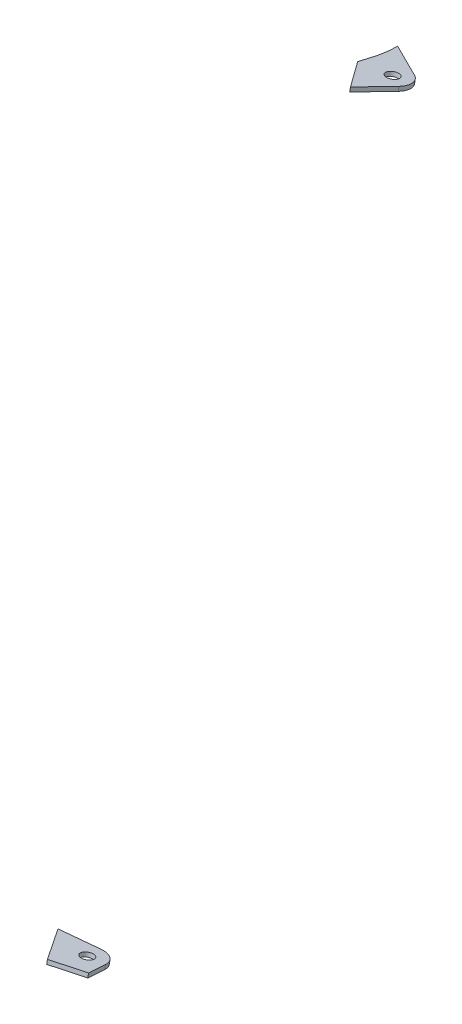
ISO-10303-21;
HEADER;
FILE_DESCRIPTION(('STEP AP214'),'2;1');
FILE_NAME('part.step','',(''),(''),'','','');
FILE_SCHEMA(('AUTOMOTIVE_DESIGN { 1 0 10303 214 1 1 1 1 }'));
ENDSEC;
DATA;
#1=APPLICATION_CONTEXT('core data for automotive mechanical design processes');
#2=APPLICATION_PROTOCOL_DEFINITION('international standard','automotive_design',2000,#1);
#3=PRODUCT_CONTEXT('',#1,'mechanical');
#4=PRODUCT('Part','Part','',(#3));
#5=PRODUCT_RELATED_PRODUCT_CATEGORY('part','',(#4));
#6=PRODUCT_DEFINITION_FORMATION('','',#4);
#7=PRODUCT_DEFINITION_CONTEXT('part definition',#1,'design');
#8=PRODUCT_DEFINITION('design','',#6,#7);
#9=PRODUCT_DEFINITION_SHAPE('','',#8);
#10=(LENGTH_UNIT() NAMED_UNIT(*) SI_UNIT(.MILLI.,.METRE.));
#11=(NAMED_UNIT(*) PLANE_ANGLE_UNIT() SI_UNIT($,.RADIAN.));
#12=(NAMED_UNIT(*) SI_UNIT($,.STERADIAN.) SOLID_ANGLE_UNIT());
#13=UNCERTAINTY_MEASURE_WITH_UNIT(LENGTH_MEASURE(1.E-05),#10,'distance_accuracy_value','');
#14=(GEOMETRIC_REPRESENTATION_CONTEXT(3) GLOBAL_UNCERTAINTY_ASSIGNED_CONTEXT((#13)) GLOBAL_UNIT_ASSIGNED_CONTEXT((#10,
#11,#12)) REPRESENTATION_CONTEXT('',''));
#15=CARTESIAN_POINT('',(0.,0.,0.));
#16=DIRECTION('',(0.,0.,1.));
#17=DIRECTION('',(1.,0.,0.));
#18=AXIS2_PLACEMENT_3D('',#15,#16,#17);
#19=CARTESIAN_POINT('',(931.782265468866,168.670718611144,-1033.61594763109));
#20=DIRECTION('',(7.70717240670275E-13,-0.981627183447704,0.190808995376337));
#21=DIRECTION('',(0.,0.190808995376337,0.981627183447704));
#22=AXIS2_PLACEMENT_3D('',#19,#20,#21);
#23=PLANE('',#22);
#24=CARTESIAN_POINT('',(931.253435448419,164.155870494627,-1056.84282764041));
#25=CARTESIAN_POINT('',(931.346908094577,164.231296417056,-1056.45479490827));
#26=CARTESIAN_POINT('',(931.433937078822,164.307083304951,-1056.06490516979));
#27=CARTESIAN_POINT('',(931.730758064932,164.585601225413,-1054.63205468356));
#28=CARTESIAN_POINT('',(931.904919364846,164.791085551674,-1053.57492946767));
#29=CARTESIAN_POINT('',(932.317793571358,165.406215469037,-1050.41036038096));
#30=CARTESIAN_POINT('',(932.450892162383,165.815461398526,-1048.30497259089));
#31=CARTESIAN_POINT('',(932.526546787791,166.632826386434,-1044.09999425983));
#32=CARTESIAN_POINT('',(932.467876959003,167.040938195084,-1042.00044101568));
#33=CARTESIAN_POINT('',(932.271293946925,167.676283122053,-1038.73187472011));
#34=CARTESIAN_POINT('',(932.179682868196,167.903790071599,-1037.56145292916));
#35=CARTESIAN_POINT('',(932.070864738085,168.131195258428,-1036.39155466201));
#36=B_SPLINE_CURVE_WITH_KNOTS('',3,(#24,#25,#26,#27,#28,#29,#30,#31,#32,#33,#34,#35),
.UNSPECIFIED.,.F.,.F.,(4,2,2,2,2,4),(0.0389952168176687,0.0625000000000052,0.12500000000001,
0.250000000000007,0.375000000000004,0.44478939743877),.UNSPECIFIED.);
#37=CARTESIAN_POINT('',(931.253435448419,164.155870494627,-1056.84282764041));
#38=VERTEX_POINT('',#37);
#39=CARTESIAN_POINT('',(932.070864738085,168.131195258428,-1036.39155466201));
#40=VERTEX_POINT('',#39);
#41=EDGE_CURVE('E137',#38,#40,#36,.T.);
#42=ORIENTED_EDGE('',*,*,#41,.F.);
#43=DIRECTION('',(-0.872283113333307,-0.0933058270450079,-0.480016867238017));
#44=VECTOR('',#43,1.);
#45=CARTESIAN_POINT('',(949.782119992386,166.137835075857,-1046.64650379453));
#46=LINE('',#45,#44);
#47=CARTESIAN_POINT('',(949.782119992386,166.137835075857,-1046.64650379453));
#48=VERTEX_POINT('',#47);
#49=EDGE_CURVE('E124',#48,#38,#46,.T.);
#50=ORIENTED_EDGE('',*,*,#49,.F.);
#51=CARTESIAN_POINT('',(945.870110420262,167.469350792169,-1039.79644926885));
#52=DIRECTION('',(0.,0.981627183447661,-0.190808995376562));
#53=DIRECTION('',(0.,0.190808995376562,0.981627183447661));
#54=AXIS2_PLACEMENT_3D('',#51,#52,#53);
#55=CIRCLE('',#54,7.9999999999998);
#56=CARTESIAN_POINT('',(952.848375326929,168.215797408529,-1035.95631433094));
#57=VERTEX_POINT('',#56);
#58=EDGE_CURVE('E108',#57,#48,#55,.T.);
#59=ORIENTED_EDGE('',*,*,#58,.F.);
#60=DIRECTION('',(0.48900119651544,-0.166439464539092,-0.856256815710338));
#61=VECTOR('',#60,1.);
#62=CARTESIAN_POINT('',(952.848375326929,168.215797408529,-1035.95631433094));
#63=LINE('',#62,#61);
#64=CARTESIAN_POINT('',(944.168784694913,171.17003643188,-1020.75807209923));
#65=VERTEX_POINT('',#64);
#66=EDGE_CURVE('E117',#65,#57,#63,.T.);
#67=ORIENTED_EDGE('',*,*,#66,.F.);
#68=CARTESIAN_POINT('',(932.070864738085,168.131195258428,-1036.39155466201));
#69=CARTESIAN_POINT('',(936.101696367413,169.14368434206,-1031.18274988068));
#70=CARTESIAN_POINT('',(940.13433811071,170.156631841329,-1025.97158675535));
#71=CARTESIAN_POINT('',(944.168784694913,171.17003643188,-1020.75807209923));
#72=(BOUNDED_CURVE() B_SPLINE_CURVE(3,(#68,#69,#70,#71),.UNSPECIFIED.,.F.,
.F.) B_SPLINE_CURVE_WITH_KNOTS((4,4),(0.,0.0283733380516184),
.UNSPECIFIED.) CURVE() GEOMETRIC_REPRESENTATION_ITEM() RATIONAL_B_SPLINE_CURVE((1.,
0.9999843991254,0.999969240899689,0.999954525322867)) REPRESENTATION_ITEM(''));
#73=EDGE_CURVE('E120',#40,#65,#72,.T.);
#74=ORIENTED_EDGE('',*,*,#73,.F.);
#75=EDGE_LOOP('',(#42,#50,#59,#67,#74));
#76=FACE_BOUND('',#75,.T.);
#77=CARTESIAN_POINT('',(945.870110420262,167.469350792169,-1039.79644926885));
#78=DIRECTION('',(0.,0.981627183447661,-0.190808995376562));
#79=DIRECTION('',(0.,0.190808995376562,0.981627183447661));
#80=AXIS2_PLACEMENT_3D('',#77,#78,#79);
#81=CIRCLE('',#80,2.99999999999994);
#82=CARTESIAN_POINT('',(945.870110420262,168.041777778299,-1036.8515677185));
#83=VERTEX_POINT('',#82);
#84=EDGE_CURVE('E176',#83,#83,#81,.T.);
#85=ORIENTED_EDGE('',*,*,#84,.T.);
#86=EDGE_LOOP('',(#85));
#87=FACE_BOUND('',#86,.T.);
#88=ADVANCED_FACE('F47',(#76,#87),#23,.T.);
#89=CARTESIAN_POINT('',(931.782265468867,170.633972978039,-1033.99756562184));
#90=DIRECTION('',(7.70717240670275E-13,-0.981627183447704,0.190808995376337));
#91=DIRECTION('',(0.,0.190808995376337,0.981627183447704));
#92=AXIS2_PLACEMENT_3D('',#89,#90,#91);
#93=PLANE('',#92);
#94=CARTESIAN_POINT('',(932.070864738085,170.094449625324,-1036.77317265276));
#95=CARTESIAN_POINT('',(932.179682868197,169.867044438495,-1037.94307091992));
#96=CARTESIAN_POINT('',(932.271293946925,169.639537488948,-1039.11349271087));
#97=CARTESIAN_POINT('',(932.467876959003,169.004192561979,-1042.38205900643));
#98=CARTESIAN_POINT('',(932.526546787791,168.596080753329,-1044.48161225058));
#99=CARTESIAN_POINT('',(932.450892162383,167.778715765421,-1048.68659058164));
#100=CARTESIAN_POINT('',(932.317793571358,167.369469835932,-1050.79197837171));
#101=CARTESIAN_POINT('',(931.904919364846,166.754339918569,-1053.95654745843));
#102=CARTESIAN_POINT('',(931.730758064932,166.548855592308,-1055.01367267431));
#103=CARTESIAN_POINT('',(931.433937078822,166.270337671846,-1056.44652316054));
#104=CARTESIAN_POINT('',(931.346908094577,166.194550783952,-1056.83641289902));
#105=CARTESIAN_POINT('',(931.25343544842,166.119124861523,-1057.22444563116));
#106=B_SPLINE_CURVE_WITH_KNOTS('',3,(#94,#95,#96,#97,#98,#99,#100,#101,#102,#103,#104,#105),
.UNSPECIFIED.,.F.,.F.,(4,2,2,2,2,4),(0.0389952168176727,0.108784614256442,0.233784614256439,
0.358784614256436,0.421284614256441,0.444789397438774),.UNSPECIFIED.);
#107=CARTESIAN_POINT('',(931.25343544842,166.119124861523,-1057.22444563116));
#108=VERTEX_POINT('',#107);
#109=CARTESIAN_POINT('',(932.070864738086,170.094449625324,-1036.77317265276));
#110=VERTEX_POINT('',#109);
#111=EDGE_CURVE('E175',#108,#110,#106,.F.);
#112=ORIENTED_EDGE('',*,*,#111,.T.);
#113=CARTESIAN_POINT('',(932.070864738086,170.094449625324,-1036.77317265276));
#114=CARTESIAN_POINT('',(936.101696367413,171.106938708956,-1031.56436787144));
#115=CARTESIAN_POINT('',(940.13433811071,172.119886208224,-1026.35320474611));
#116=CARTESIAN_POINT('',(944.168784694914,173.133290798775,-1021.13969008998));
#117=(BOUNDED_CURVE() B_SPLINE_CURVE(3,(#113,#114,#115,#116),.UNSPECIFIED.,.F.,
.F.) B_SPLINE_CURVE_WITH_KNOTS((4,4),(0.,0.0283733380516184),
.UNSPECIFIED.) CURVE() GEOMETRIC_REPRESENTATION_ITEM() RATIONAL_B_SPLINE_CURVE((1.,
0.9999843991254,0.999969240899689,0.999954525322867)) REPRESENTATION_ITEM(''));
#118=CARTESIAN_POINT('',(944.168784694914,173.133290798775,-1021.13969008998));
#119=VERTEX_POINT('',#118);
#120=EDGE_CURVE('E131',#110,#119,#117,.T.);
#121=ORIENTED_EDGE('',*,*,#120,.T.);
#122=DIRECTION('',(0.48900119651544,-0.166439464539092,-0.856256815710338));
#123=VECTOR('',#122,1.);
#124=CARTESIAN_POINT('',(952.848375326929,170.179051775425,-1036.3379323217));
#125=LINE('',#124,#123);
#126=CARTESIAN_POINT('',(952.848375326929,170.179051775425,-1036.3379323217));
#127=VERTEX_POINT('',#126);
#128=EDGE_CURVE('E129',#119,#127,#125,.T.);
#129=ORIENTED_EDGE('',*,*,#128,.T.);
#130=CARTESIAN_POINT('',(945.870110420263,169.432605159065,-1040.1780672596));
#131=DIRECTION('',(0.,0.981627183447661,-0.190808995376562));
#132=DIRECTION('',(0.,0.190808995376562,0.981627183447661));
#133=AXIS2_PLACEMENT_3D('',#130,#131,#132);
#134=CIRCLE('',#133,7.9999999999998);
#135=CARTESIAN_POINT('',(949.782119992386,168.101089442752,-1047.02812178528));
#136=VERTEX_POINT('',#135);
#137=EDGE_CURVE('E111',#127,#136,#134,.T.);
#138=ORIENTED_EDGE('',*,*,#137,.T.);
#139=DIRECTION('',(-0.872283113333307,-0.0933058270450079,-0.480016867238017));
#140=VECTOR('',#139,1.);
#141=CARTESIAN_POINT('',(949.782119992386,168.101089442752,-1047.02812178528));
#142=LINE('',#141,#140);
#143=EDGE_CURVE('E133',#136,#108,#142,.T.);
#144=ORIENTED_EDGE('',*,*,#143,.T.);
#145=EDGE_LOOP('',(#112,#121,#129,#138,#144));
#146=FACE_BOUND('',#145,.T.);
#147=CARTESIAN_POINT('',(945.870110420263,169.432605159065,-1040.1780672596));
#148=DIRECTION('',(0.,0.981627183447661,-0.190808995376562));
#149=DIRECTION('',(0.,0.190808995376562,0.981627183447661));
#150=AXIS2_PLACEMENT_3D('',#147,#148,#149);
#151=CIRCLE('',#150,2.99999999999994);
#152=CARTESIAN_POINT('',(945.870110420263,170.005032145194,-1037.23318570926));
#153=VERTEX_POINT('',#152);
#154=EDGE_CURVE('E178',#153,#153,#151,.T.);
#155=ORIENTED_EDGE('',*,*,#154,.F.);
#156=EDGE_LOOP('',(#155));
#157=FACE_BOUND('',#156,.T.);
#158=ADVANCED_FACE('F152',(#146,#157),#93,.F.);
#159=CARTESIAN_POINT('',(930.732564563358,163.783585494169,-1058.7580679346));
#160=CARTESIAN_POINT('',(931.041876457739,163.980741553249,-1057.74378793909));
#161=CARTESIAN_POINT('',(931.299356206909,164.180801180932,-1056.71457037805));
#162=CARTESIAN_POINT('',(931.730758064932,164.585601225413,-1054.63205468356));
#163=CARTESIAN_POINT('',(931.904919364846,164.791085551674,-1053.57492946767));
#164=CARTESIAN_POINT('',(932.317793571358,165.406215469037,-1050.41036038096));
#165=CARTESIAN_POINT('',(932.450892162383,165.815461398526,-1048.30497259089));
#166=CARTESIAN_POINT('',(932.526546787791,166.632826386434,-1044.09999425983));
#167=CARTESIAN_POINT('',(932.467876959003,167.040938195084,-1042.00044101568));
#168=CARTESIAN_POINT('',(932.215574966873,167.856363643444,-1037.80544075059));
#169=CARTESIAN_POINT('',(932.021480478628,168.263674548959,-1035.71000779588));
#170=CARTESIAN_POINT('',(931.543050459105,169.077762673329,-1031.5218874663));
#171=CARTESIAN_POINT('',(931.258376102624,169.48464387669,-1029.42866513752));
#172=CARTESIAN_POINT('',(930.642221592083,170.297653555056,-1025.24609293166));
#173=CARTESIAN_POINT('',(930.310786136075,170.703532520534,-1023.15802666982));
#174=CARTESIAN_POINT('',(929.317291250156,171.921191160306,-1016.8937160245));
#175=CARTESIAN_POINT('',(928.65223246682,172.732890468118,-1012.71788509073));
#176=CARTESIAN_POINT('',(928.221183683063,173.550859980871,-1008.50979674896));
#177=B_SPLINE_CURVE_WITH_KNOTS('',3,(#159,#160,#161,#162,#163,#164,#165,#166,#167,#168,#169,
#170,#171,#172,#173,#174,#175,#176),.UNSPECIFIED.,.F.,.F.,(4,2,2,2,2,2,2,2,4),(0.,
0.0625000000000052,0.12500000000001,0.250000000000007,0.375000000000004,0.500000000000001,
0.624999999999998,0.749999999999995,1.),.UNSPECIFIED.);
#178=DIRECTION('',(0.,0.981627183447661,-0.190808995376562));
#179=VECTOR('',#178,1.);
#180=SURFACE_OF_LINEAR_EXTRUSION('',#177,#179);
#181=ORIENTED_EDGE('',*,*,#111,.F.);
#182=DIRECTION('',(0.,0.981627183447661,-0.190808995376562));
#183=VECTOR('',#182,1.);
#184=CARTESIAN_POINT('',(931.253435448419,164.155870494627,-1056.84282764041));
#185=LINE('',#184,#183);
#186=EDGE_CURVE('E70',#38,#108,#185,.T.);
#187=ORIENTED_EDGE('',*,*,#186,.F.);
#188=ORIENTED_EDGE('',*,*,#41,.T.);
#189=DIRECTION('',(0.,0.981627183447661,-0.190808995376562));
#190=VECTOR('',#189,1.);
#191=CARTESIAN_POINT('',(932.070864738085,168.131195258428,-1036.39155466201));
#192=LINE('',#191,#190);
#193=EDGE_CURVE('E12',#40,#110,#192,.T.);
#194=ORIENTED_EDGE('',*,*,#193,.T.);
#195=EDGE_LOOP('',(#181,#187,#188,#194));
#196=FACE_BOUND('',#195,.T.);
#197=ADVANCED_FACE('F49',(#196),#180,.T.);
#198=DIRECTION('',(0.,0.981627183447661,-0.190808995376562));
#199=VECTOR('',#198,1.);
#200=SURFACE_OF_LINEAR_EXTRUSION('',#72,#199);
#201=ORIENTED_EDGE('',*,*,#120,.F.);
#202=ORIENTED_EDGE('',*,*,#193,.F.);
#203=ORIENTED_EDGE('',*,*,#73,.T.);
#204=DIRECTION('',(0.,0.981627183447661,-0.190808995376562));
#205=VECTOR('',#204,1.);
#206=CARTESIAN_POINT('',(944.168784694913,171.17003643188,-1020.75807209923));
#207=LINE('',#206,#205);
#208=EDGE_CURVE('E61',#65,#119,#207,.T.);
#209=ORIENTED_EDGE('',*,*,#208,.T.);
#210=EDGE_LOOP('',(#201,#202,#203,#209));
#211=FACE_BOUND('',#210,.T.);
#212=ADVANCED_FACE('F196',(#211),#200,.T.);
#213=CARTESIAN_POINT('',(952.848375326929,168.215797408529,-1035.95631433094));
#214=DIRECTION('',(-0.872283113333319,-0.0933058270450053,-0.480016867237996));
#215=DIRECTION('',(0.482120118377001,0.,-0.876105125801776));
#216=AXIS2_PLACEMENT_3D('',#213,#214,#215);
#217=PLANE('',#216);
#218=ORIENTED_EDGE('',*,*,#128,.F.);
#219=ORIENTED_EDGE('',*,*,#208,.F.);
#220=ORIENTED_EDGE('',*,*,#66,.T.);
#221=DIRECTION('',(0.,0.981627183447661,-0.190808995376562));
#222=VECTOR('',#221,1.);
#223=CARTESIAN_POINT('',(952.848375326929,168.215797408529,-1035.95631433094));
#224=LINE('',#223,#222);
#225=EDGE_CURVE('E104',#57,#127,#224,.T.);
#226=ORIENTED_EDGE('',*,*,#225,.T.);
#227=EDGE_LOOP('',(#218,#219,#220,#226));
#228=FACE_BOUND('',#227,.T.);
#229=ADVANCED_FACE('F118',(#228),#217,.F.);
#230=CARTESIAN_POINT('',(945.870110420262,167.469350792169,-1039.79644926885));
#231=DIRECTION('',(0.,0.981627183447661,-0.190808995376562));
#232=DIRECTION('',(0.,-0.190808995376562,-0.981627183447661));
#233=AXIS2_PLACEMENT_3D('',#230,#231,#232);
#234=CYLINDRICAL_SURFACE('',#233,7.9999999999998);
#235=ORIENTED_EDGE('',*,*,#137,.F.);
#236=ORIENTED_EDGE('',*,*,#225,.F.);
#237=ORIENTED_EDGE('',*,*,#58,.T.);
#238=DIRECTION('',(0.,0.981627183447661,-0.190808995376562));
#239=VECTOR('',#238,1.);
#240=CARTESIAN_POINT('',(949.782119992386,166.137835075857,-1046.64650379453));
#241=LINE('',#240,#239);
#242=EDGE_CURVE('E89',#48,#136,#241,.T.);
#243=ORIENTED_EDGE('',*,*,#242,.T.);
#244=EDGE_LOOP('',(#235,#236,#237,#243));
#245=FACE_BOUND('',#244,.T.);
#246=ADVANCED_FACE('F106',(#245),#234,.T.);
#247=CARTESIAN_POINT('',(949.782119992386,166.137835075857,-1046.64650379453));
#248=DIRECTION('',(-0.489001196515461,0.166439464539092,0.856256815710326));
#249=DIRECTION('',(-0.868369110783463,0.,-0.495918428208851));
#250=AXIS2_PLACEMENT_3D('',#247,#248,#249);
#251=PLANE('',#250);
#252=ORIENTED_EDGE('',*,*,#143,.F.);
#253=ORIENTED_EDGE('',*,*,#242,.F.);
#254=ORIENTED_EDGE('',*,*,#49,.T.);
#255=ORIENTED_EDGE('',*,*,#186,.T.);
#256=EDGE_LOOP('',(#252,#253,#254,#255));
#257=FACE_BOUND('',#256,.T.);
#258=ADVANCED_FACE('F158',(#257),#251,.F.);
#259=CARTESIAN_POINT('',(945.870110420262,167.469350792169,-1039.79644926885));
#260=DIRECTION('',(0.,0.981627183447661,-0.190808995376562));
#261=DIRECTION('',(0.,-0.190808995376562,-0.981627183447661));
#262=AXIS2_PLACEMENT_3D('',#259,#260,#261);
#263=CYLINDRICAL_SURFACE('',#262,2.99999999999994);
#264=ORIENTED_EDGE('',*,*,#84,.F.);
#265=EDGE_LOOP('',(#264));
#266=FACE_BOUND('',#265,.T.);
#267=ORIENTED_EDGE('',*,*,#154,.T.);
#268=EDGE_LOOP('',(#267));
#269=FACE_BOUND('',#268,.T.);
#270=ADVANCED_FACE('F153',(#266,#269),#263,.F.);
#271=CLOSED_SHELL('',(#88,#158,#197,#212,#229,#246,#258,#270));
#272=MANIFOLD_SOLID_BREP('B2',#271);
#273=CARTESIAN_POINT('',(1354.98932451011,276.212451039503,-480.361696182311));
#274=DIRECTION('',(0.,-0.981627183447661,0.190808995376562));
#275=DIRECTION('',(0.,0.190808995376562,0.981627183447661));
#276=AXIS2_PLACEMENT_3D('',#273,#274,#275);
#277=PLANE('',#276);
#278=CARTESIAN_POINT('',(1354.98932451011,276.212451039503,-480.361696182311));
#279=DIRECTION('',(0.,0.981627183447661,-0.190808995376562));
#280=DIRECTION('',(0.,0.190808995376562,0.981627183447661));
#281=AXIS2_PLACEMENT_3D('',#278,#279,#280);
#282=CIRCLE('',#281,7.99999999999986);
#283=CARTESIAN_POINT('',(1362.92379772878,276.017476852442,-481.364751419359));
#284=VERTEX_POINT('',#283);
#285=CARTESIAN_POINT('',(1353.96749539416,274.698482175806,-488.150390780096));
#286=VERTEX_POINT('',#285);
#287=EDGE_CURVE('E409',#284,#286,#282,.T.);
#288=ORIENTED_EDGE('',*,*,#287,.F.);
#289=DIRECTION('',(-0.127728639492943,-0.189246107962105,-0.973586824723135));
#290=VECTOR('',#289,1.);
#291=CARTESIAN_POINT('',(1362.92379772878,276.017476852442,-481.364751419359));
#292=LINE('',#291,#290);
#293=CARTESIAN_POINT('',(1364.18260300115,277.882555815343,-471.769751950667));
#294=VERTEX_POINT('',#293);
#295=EDGE_CURVE('E357',#294,#284,#292,.T.);
#296=ORIENTED_EDGE('',*,*,#295,.F.);
#297=CARTESIAN_POINT('',(1349.30810444123,278.92517838675,-466.4059238138));
#298=CARTESIAN_POINT('',(1354.32710970895,278.559702671223,-468.286133373849));
#299=CARTESIAN_POINT('',(1359.30519225234,278.211483863424,-470.077563839949));
#300=CARTESIAN_POINT('',(1364.18260300115,277.882555815343,-471.769751950667));
#301=(BOUNDED_CURVE() B_SPLINE_CURVE(3,(#297,#298,#299,#300),.UNSPECIFIED.,.F.,
.F.) B_SPLINE_CURVE_WITH_KNOTS((4,4),(0.918491708652487,1.),
.UNSPECIFIED.) CURVE() GEOMETRIC_REPRESENTATION_ITEM() RATIONAL_B_SPLINE_CURVE((0.85094018893203,
0.896217531077208,0.945904134766531,1.)) REPRESENTATION_ITEM(''));
#302=CARTESIAN_POINT('',(1349.30810444123,278.92517838675,-466.4059238138));
#303=VERTEX_POINT('',#302);
#304=EDGE_CURVE('E341',#303,#294,#301,.T.);
#305=ORIENTED_EDGE('',*,*,#304,.F.);
#306=CARTESIAN_POINT('',(932.070823715363,168.131184366595,-1036.39161069563));
#307=CARTESIAN_POINT('',(1069.20322965112,204.540840618542,-849.080167404562));
#308=CARTESIAN_POINT('',(1208.35883693005,241.492489555356,-658.980413469935));
#309=CARTESIAN_POINT('',(1349.30810444123,278.92517838675,-466.4059238138));
#310=(BOUNDED_CURVE() B_SPLINE_CURVE(3,(#306,#307,#308,#309),.UNSPECIFIED.,.F.,
.F.) B_SPLINE_CURVE_WITH_KNOTS((4,4),(0.,1.),
.UNSPECIFIED.) CURVE() GEOMETRIC_REPRESENTATION_ITEM() RATIONAL_B_SPLINE_CURVE((1.,
0.999450157236647,0.999450157236647,1.)) REPRESENTATION_ITEM(''));
#311=CARTESIAN_POINT('',(1335.13531275182,275.16124629386,-485.769675778116));
#312=VERTEX_POINT('',#311);
#313=EDGE_CURVE('E350',#312,#303,#310,.T.);
#314=ORIENTED_EDGE('',*,*,#313,.F.);
#315=DIRECTION('',(-0.991809152333897,0.0243717733825106,0.125381904631039));
#316=VECTOR('',#315,1.);
#317=CARTESIAN_POINT('',(1353.96749539416,274.698482175806,-488.150390780096));
#318=LINE('',#317,#316);
#319=EDGE_CURVE('E353',#286,#312,#318,.T.);
#320=ORIENTED_EDGE('',*,*,#319,.F.);
#321=EDGE_LOOP('',(#288,#296,#305,#314,#320));
#322=FACE_BOUND('',#321,.T.);
#323=CARTESIAN_POINT('',(1354.98932451011,276.212451039503,-480.361696182311));
#324=DIRECTION('',(0.,0.981627183447661,-0.190808995376562));
#325=DIRECTION('',(0.,0.190808995376562,0.981627183447661));
#326=AXIS2_PLACEMENT_3D('',#323,#324,#325);
#327=CIRCLE('',#326,2.99999999999994);
#328=CARTESIAN_POINT('',(1354.98932451011,276.784878025632,-477.416814631968));
#329=VERTEX_POINT('',#328);
#330=EDGE_CURVE('E400',#329,#329,#327,.T.);
#331=ORIENTED_EDGE('',*,*,#330,.T.);
#332=EDGE_LOOP('',(#331));
#333=FACE_BOUND('',#332,.T.);
#334=ADVANCED_FACE('F286',(#322,#333),#277,.T.);
#335=CARTESIAN_POINT('',(1354.98932451011,278.175705406398,-480.743314173064));
#336=DIRECTION('',(0.,-0.981627183447661,0.190808995376562));
#337=DIRECTION('',(0.,0.190808995376562,0.981627183447661));
#338=AXIS2_PLACEMENT_3D('',#335,#336,#337);
#339=PLANE('',#338);
#340=CARTESIAN_POINT('',(1354.98932451011,278.175705406398,-480.743314173064));
#341=DIRECTION('',(0.,0.981627183447661,-0.190808995376562));
#342=DIRECTION('',(0.,0.190808995376562,0.981627183447661));
#343=AXIS2_PLACEMENT_3D('',#340,#341,#342);
#344=CIRCLE('',#343,7.99999999999986);
#345=CARTESIAN_POINT('',(1362.92379772878,277.980731219338,-481.746369410112));
#346=VERTEX_POINT('',#345);
#347=CARTESIAN_POINT('',(1353.96749539416,276.661736542701,-488.532008770849));
#348=VERTEX_POINT('',#347);
#349=EDGE_CURVE('E406',#346,#348,#344,.T.);
#350=ORIENTED_EDGE('',*,*,#349,.T.);
#351=DIRECTION('',(-0.991809152333897,0.0243717733825106,0.125381904631039));
#352=VECTOR('',#351,1.);
#353=CARTESIAN_POINT('',(1353.96749539416,276.661736542701,-488.532008770849));
#354=LINE('',#353,#352);
#355=CARTESIAN_POINT('',(1335.13531275182,277.124500660756,-486.151293768869));
#356=VERTEX_POINT('',#355);
#357=EDGE_CURVE('E413',#348,#356,#354,.T.);
#358=ORIENTED_EDGE('',*,*,#357,.T.);
#359=CARTESIAN_POINT('',(932.070823715363,170.094438733491,-1036.77322868639));
#360=CARTESIAN_POINT('',(1069.20322965112,206.504094985438,-849.461785395315));
#361=CARTESIAN_POINT('',(1208.35883693005,243.455743922251,-659.362031460688));
#362=CARTESIAN_POINT('',(1349.30810444123,280.888432753645,-466.787541804553));
#363=(BOUNDED_CURVE() B_SPLINE_CURVE(3,(#359,#360,#361,#362),.UNSPECIFIED.,.F.,
.F.) B_SPLINE_CURVE_WITH_KNOTS((4,4),(0.,1.),
.UNSPECIFIED.) CURVE() GEOMETRIC_REPRESENTATION_ITEM() RATIONAL_B_SPLINE_CURVE((1.,
0.999450157236647,0.999450157236647,1.)) REPRESENTATION_ITEM(''));
#364=CARTESIAN_POINT('',(1349.30810444123,280.888432753645,-466.787541804553));
#365=VERTEX_POINT('',#364);
#366=EDGE_CURVE('E414',#356,#365,#363,.T.);
#367=ORIENTED_EDGE('',*,*,#366,.T.);
#368=CARTESIAN_POINT('',(1349.30810444123,280.888432753645,-466.787541804553));
#369=CARTESIAN_POINT('',(1354.32710970895,280.522957038119,-468.667751364602));
#370=CARTESIAN_POINT('',(1359.30519225234,280.174738230319,-470.459181830702));
#371=CARTESIAN_POINT('',(1364.18260300115,279.845810182238,-472.15136994142));
#372=(BOUNDED_CURVE() B_SPLINE_CURVE(3,(#368,#369,#370,#371),.UNSPECIFIED.,.F.,
.F.) B_SPLINE_CURVE_WITH_KNOTS((4,4),(0.918491708652487,1.),
.UNSPECIFIED.) CURVE() GEOMETRIC_REPRESENTATION_ITEM() RATIONAL_B_SPLINE_CURVE((0.85094018893203,
0.896217531077208,0.945904134766531,1.)) REPRESENTATION_ITEM(''));
#373=CARTESIAN_POINT('',(1364.18260300115,279.845810182238,-472.15136994142));
#374=VERTEX_POINT('',#373);
#375=EDGE_CURVE('E344',#365,#374,#372,.T.);
#376=ORIENTED_EDGE('',*,*,#375,.T.);
#377=DIRECTION('',(-0.127728639492943,-0.189246107962105,-0.973586824723135));
#378=VECTOR('',#377,1.);
#379=CARTESIAN_POINT('',(1362.92379772878,277.980731219338,-481.746369410112));
#380=LINE('',#379,#378);
#381=EDGE_CURVE('E410',#374,#346,#380,.T.);
#382=ORIENTED_EDGE('',*,*,#381,.T.);
#383=EDGE_LOOP('',(#350,#358,#367,#376,#382));
#384=FACE_BOUND('',#383,.T.);
#385=CARTESIAN_POINT('',(1354.98932451011,278.175705406398,-480.743314173064));
#386=DIRECTION('',(0.,0.981627183447661,-0.190808995376562));
#387=DIRECTION('',(0.,0.190808995376562,0.981627183447661));
#388=AXIS2_PLACEMENT_3D('',#385,#386,#387);
#389=CIRCLE('',#388,2.99999999999994);
#390=CARTESIAN_POINT('',(1354.98932451011,278.748132392528,-477.798432622721));
#391=VERTEX_POINT('',#390);
#392=EDGE_CURVE('E403',#391,#391,#389,.T.);
#393=ORIENTED_EDGE('',*,*,#392,.F.);
#394=EDGE_LOOP('',(#393));
#395=FACE_BOUND('',#394,.T.);
#396=ADVANCED_FACE('F383',(#384,#395),#339,.F.);
#397=CARTESIAN_POINT('',(1354.98932451011,276.212451039503,-480.361696182311));
#398=DIRECTION('',(0.,0.981627183447661,-0.190808995376562));
#399=DIRECTION('',(0.,-0.190808995376562,-0.981627183447661));
#400=AXIS2_PLACEMENT_3D('',#397,#398,#399);
#401=CYLINDRICAL_SURFACE('',#400,7.99999999999986);
#402=ORIENTED_EDGE('',*,*,#349,.F.);
#403=DIRECTION('',(0.,0.981627183447661,-0.190808995376562));
#404=VECTOR('',#403,1.);
#405=CARTESIAN_POINT('',(1362.92379772878,276.017476852442,-481.364751419359));
#406=LINE('',#405,#404);
#407=EDGE_CURVE('E303',#284,#346,#406,.T.);
#408=ORIENTED_EDGE('',*,*,#407,.F.);
#409=ORIENTED_EDGE('',*,*,#287,.T.);
#410=DIRECTION('',(0.,0.981627183447661,-0.190808995376562));
#411=VECTOR('',#410,1.);
#412=CARTESIAN_POINT('',(1353.96749539416,274.698482175806,-488.150390780096));
#413=LINE('',#412,#411);
#414=EDGE_CURVE('E45',#286,#348,#413,.T.);
#415=ORIENTED_EDGE('',*,*,#414,.T.);
#416=EDGE_LOOP('',(#402,#408,#409,#415));
#417=FACE_BOUND('',#416,.T.);
#418=ADVANCED_FACE('F288',(#417),#401,.T.);
#419=CARTESIAN_POINT('',(1353.96749539416,274.698482175806,-488.150390780096));
#420=DIRECTION('',(0.127728639492932,0.189246107962104,0.973586824723137));
#421=DIRECTION('',(0.,0.981627183447662,-0.190808995376555));
#422=AXIS2_PLACEMENT_3D('',#419,#420,#421);
#423=PLANE('',#422);
#424=ORIENTED_EDGE('',*,*,#357,.F.);
#425=ORIENTED_EDGE('',*,*,#414,.F.);
#426=ORIENTED_EDGE('',*,*,#319,.T.);
#427=DIRECTION('',(0.,0.981627183447661,-0.190808995376562));
#428=VECTOR('',#427,1.);
#429=CARTESIAN_POINT('',(1335.13531275182,275.16124629386,-485.769675778116));
#430=LINE('',#429,#428);
#431=EDGE_CURVE('E295',#312,#356,#430,.T.);
#432=ORIENTED_EDGE('',*,*,#431,.T.);
#433=EDGE_LOOP('',(#424,#425,#426,#432));
#434=FACE_BOUND('',#433,.T.);
#435=ADVANCED_FACE('F378',(#434),#423,.F.);
#436=DIRECTION('',(0.,0.981627183447661,-0.190808995376562));
#437=VECTOR('',#436,1.);
#438=SURFACE_OF_LINEAR_EXTRUSION('',#310,#437);
#439=ORIENTED_EDGE('',*,*,#366,.F.);
#440=ORIENTED_EDGE('',*,*,#431,.F.);
#441=ORIENTED_EDGE('',*,*,#313,.T.);
#442=DIRECTION('',(0.,0.981627183447661,-0.190808995376562));
#443=VECTOR('',#442,1.);
#444=CARTESIAN_POINT('',(1349.30810444123,278.92517838675,-466.4059238138));
#445=LINE('',#444,#443);
#446=EDGE_CURVE('E337',#303,#365,#445,.T.);
#447=ORIENTED_EDGE('',*,*,#446,.T.);
#448=EDGE_LOOP('',(#439,#440,#441,#447));
#449=FACE_BOUND('',#448,.T.);
#450=ADVANCED_FACE('F351',(#449),#438,.T.);
#451=DIRECTION('',(0.,0.981627183447661,-0.190808995376562));
#452=VECTOR('',#451,1.);
#453=SURFACE_OF_LINEAR_EXTRUSION('',#301,#452);
#454=ORIENTED_EDGE('',*,*,#375,.F.);
#455=ORIENTED_EDGE('',*,*,#446,.F.);
#456=ORIENTED_EDGE('',*,*,#304,.T.);
#457=DIRECTION('',(0.,0.981627183447661,-0.190808995376562));
#458=VECTOR('',#457,1.);
#459=CARTESIAN_POINT('',(1364.18260300115,277.882555815343,-471.769751950667));
#460=LINE('',#459,#458);
#461=EDGE_CURVE('E322',#294,#374,#460,.T.);
#462=ORIENTED_EDGE('',*,*,#461,.T.);
#463=EDGE_LOOP('',(#454,#455,#456,#462));
#464=FACE_BOUND('',#463,.T.);
#465=ADVANCED_FACE('F339',(#464),#453,.T.);
#466=CARTESIAN_POINT('',(1362.92379772878,276.017476852442,-481.364751419359));
#467=DIRECTION('',(-0.991809152333896,0.0243717733825117,0.12538190463105));
#468=DIRECTION('',(-0.125419158609161,0.,-0.992103842676648));
#469=AXIS2_PLACEMENT_3D('',#466,#467,#468);
#470=PLANE('',#469);
#471=ORIENTED_EDGE('',*,*,#381,.F.);
#472=ORIENTED_EDGE('',*,*,#461,.F.);
#473=ORIENTED_EDGE('',*,*,#295,.T.);
#474=ORIENTED_EDGE('',*,*,#407,.T.);
#475=EDGE_LOOP('',(#471,#472,#473,#474));
#476=FACE_BOUND('',#475,.T.);
#477=ADVANCED_FACE('F375',(#476),#470,.F.);
#478=CARTESIAN_POINT('',(1354.98932451011,276.212451039503,-480.361696182311));
#479=DIRECTION('',(0.,0.981627183447661,-0.190808995376562));
#480=DIRECTION('',(0.,-0.190808995376562,-0.981627183447661));
#481=AXIS2_PLACEMENT_3D('',#478,#479,#480);
#482=CYLINDRICAL_SURFACE('',#481,2.99999999999994);
#483=ORIENTED_EDGE('',*,*,#330,.F.);
#484=EDGE_LOOP('',(#483));
#485=FACE_BOUND('',#484,.T.);
#486=ORIENTED_EDGE('',*,*,#392,.T.);
#487=EDGE_LOOP('',(#486));
#488=FACE_BOUND('',#487,.T.);
#489=ADVANCED_FACE('F391',(#485,#488),#482,.F.);
#490=CLOSED_SHELL('',(#334,#396,#418,#435,#450,#465,#477,#489));
#491=MANIFOLD_SOLID_BREP('B6',#490);
#492=ADVANCED_BREP_SHAPE_REPRESENTATION('',(#18,#272,#491),#14);
#493=SHAPE_DEFINITION_REPRESENTATION(#9,#492);
ENDSEC;
END-ISO-10303-21;
